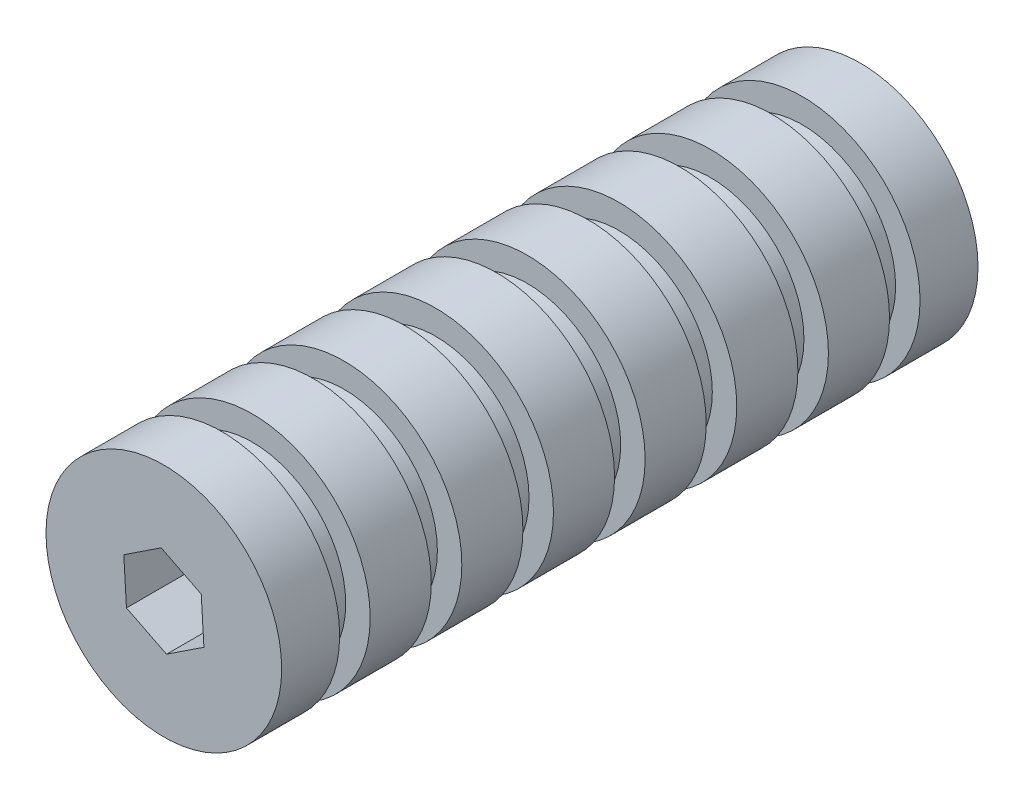
ISO-10303-21;
HEADER;
FILE_DESCRIPTION(('STEP AP214'),'2;1');
FILE_NAME('part.step','',(''),(''),'','','');
FILE_SCHEMA(('AUTOMOTIVE_DESIGN { 1 0 10303 214 1 1 1 1 }'));
ENDSEC;
DATA;
#1=APPLICATION_CONTEXT('core data for automotive mechanical design processes');
#2=APPLICATION_PROTOCOL_DEFINITION('international standard','automotive_design',2000,#1);
#3=PRODUCT_CONTEXT('',#1,'mechanical');
#4=PRODUCT('Part','Part','',(#3));
#5=PRODUCT_RELATED_PRODUCT_CATEGORY('part','',(#4));
#6=PRODUCT_DEFINITION_FORMATION('','',#4);
#7=PRODUCT_DEFINITION_CONTEXT('part definition',#1,'design');
#8=PRODUCT_DEFINITION('design','',#6,#7);
#9=PRODUCT_DEFINITION_SHAPE('','',#8);
#10=(LENGTH_UNIT() NAMED_UNIT(*) SI_UNIT(.MILLI.,.METRE.));
#11=(NAMED_UNIT(*) PLANE_ANGLE_UNIT() SI_UNIT($,.RADIAN.));
#12=(NAMED_UNIT(*) SI_UNIT($,.STERADIAN.) SOLID_ANGLE_UNIT());
#13=UNCERTAINTY_MEASURE_WITH_UNIT(LENGTH_MEASURE(1.E-05),#10,'distance_accuracy_value','');
#14=(GEOMETRIC_REPRESENTATION_CONTEXT(3) GLOBAL_UNCERTAINTY_ASSIGNED_CONTEXT((#13)) GLOBAL_UNIT_ASSIGNED_CONTEXT((#10,
#11,#12)) REPRESENTATION_CONTEXT('',''));
#15=CARTESIAN_POINT('',(0.,0.,0.));
#16=DIRECTION('',(0.,0.,1.));
#17=DIRECTION('',(1.,0.,0.));
#18=AXIS2_PLACEMENT_3D('',#15,#16,#17);
#19=CARTESIAN_POINT('',(0.,0.,0.));
#20=DIRECTION('',(0.,0.,1.));
#21=DIRECTION('',(1.,0.,0.));
#22=AXIS2_PLACEMENT_3D('',#19,#20,#21);
#23=CYLINDRICAL_SURFACE('',#22,19.2875);
#24=CARTESIAN_POINT('',(0.,0.,0.5155));
#25=DIRECTION('',(0.,0.,1.));
#26=DIRECTION('',(1.,0.,0.));
#27=AXIS2_PLACEMENT_3D('',#24,#25,#26);
#28=CIRCLE('',#27,19.2875);
#29=CARTESIAN_POINT('',(19.2875,0.,0.5155));
#30=VERTEX_POINT('',#29);
#31=EDGE_CURVE('E19',#30,#30,#28,.T.);
#32=ORIENTED_EDGE('',*,*,#31,.T.);
#33=EDGE_LOOP('',(#32));
#34=FACE_BOUND('',#33,.T.);
#35=CARTESIAN_POINT('',(0.,0.,10.));
#36=DIRECTION('',(0.,0.,1.));
#37=DIRECTION('',(1.,0.,0.));
#38=AXIS2_PLACEMENT_3D('',#35,#36,#37);
#39=CIRCLE('',#38,19.2875);
#40=CARTESIAN_POINT('',(19.2875,0.,10.));
#41=VERTEX_POINT('',#40);
#42=EDGE_CURVE('E80',#41,#41,#39,.T.);
#43=ORIENTED_EDGE('',*,*,#42,.F.);
#44=EDGE_LOOP('',(#43));
#45=FACE_BOUND('',#44,.T.);
#46=ADVANCED_FACE('F16',(#34,#45),#23,.T.);
#47=CARTESIAN_POINT('',(0.,0.,0.5155));
#48=DIRECTION('',(0.,0.,1.));
#49=DIRECTION('',(1.,0.,0.));
#50=AXIS2_PLACEMENT_3D('',#47,#48,#49);
#51=PLANE('',#50);
#52=DIRECTION('',(-0.8345119301207,-0.550989871491504,0.));
#53=VECTOR('',#52,1.);
#54=CARTESIAN_POINT('',(6.55825179957789,-3.27912589978895,0.5155));
#55=LINE('',#54,#53);
#56=CARTESIAN_POINT('',(6.55825179957789,-3.27912589978895,0.5155));
#57=VERTEX_POINT('',#56);
#58=CARTESIAN_POINT('',(0.439319568364208,-7.31917561274394,0.5155));
#59=VERTEX_POINT('',#58);
#60=EDGE_CURVE('E177',#57,#59,#55,.T.);
#61=ORIENTED_EDGE('',*,*,#60,.F.);
#62=DIRECTION('',(0.0599152608792156,-0.998203466991462,0.));
#63=VECTOR('',#62,1.);
#64=CARTESIAN_POINT('',(6.11893223121368,4.04004971295499,0.5155));
#65=LINE('',#64,#63);
#66=CARTESIAN_POINT('',(6.11893223121368,4.04004971295499,0.5155));
#67=VERTEX_POINT('',#66);
#68=EDGE_CURVE('E566',#67,#57,#65,.T.);
#69=ORIENTED_EDGE('',*,*,#68,.F.);
#70=DIRECTION('',(0.894427190999916,-0.447213595499959,0.));
#71=VECTOR('',#70,1.);
#72=CARTESIAN_POINT('',(-0.439319568364211,7.31917561274394,0.5155));
#73=LINE('',#72,#71);
#74=CARTESIAN_POINT('',(-0.439319568364214,7.31917561274394,0.5155));
#75=VERTEX_POINT('',#74);
#76=EDGE_CURVE('E561',#75,#67,#73,.T.);
#77=ORIENTED_EDGE('',*,*,#76,.F.);
#78=DIRECTION('',(0.8345119301207,0.550989871491504,0.));
#79=VECTOR('',#78,1.);
#80=CARTESIAN_POINT('',(-6.5582517995779,3.27912589978896,0.5155));
#81=LINE('',#80,#79);
#82=CARTESIAN_POINT('',(-6.5582517995779,3.27912589978896,0.5155));
#83=VERTEX_POINT('',#82);
#84=EDGE_CURVE('E85',#83,#75,#81,.T.);
#85=ORIENTED_EDGE('',*,*,#84,.F.);
#86=DIRECTION('',(-0.0599152608792152,0.998203466991462,0.));
#87=VECTOR('',#86,1.);
#88=CARTESIAN_POINT('',(-6.11893223121369,-4.04004971295499,0.5155));
#89=LINE('',#88,#87);
#90=CARTESIAN_POINT('',(-6.11893223121369,-4.04004971295499,0.5155));
#91=VERTEX_POINT('',#90);
#92=EDGE_CURVE('E66',#91,#83,#89,.T.);
#93=ORIENTED_EDGE('',*,*,#92,.F.);
#94=DIRECTION('',(-0.894427190999916,0.447213595499958,0.));
#95=VECTOR('',#94,1.);
#96=CARTESIAN_POINT('',(0.439319568364209,-7.31917561274394,0.5155));
#97=LINE('',#96,#95);
#98=EDGE_CURVE('E71',#59,#91,#97,.T.);
#99=ORIENTED_EDGE('',*,*,#98,.F.);
#100=EDGE_LOOP('',(#61,#69,#77,#85,#93,#99));
#101=FACE_BOUND('',#100,.T.);
#102=ORIENTED_EDGE('',*,*,#31,.F.);
#103=EDGE_LOOP('',(#102));
#104=FACE_BOUND('',#103,.T.);
#105=ADVANCED_FACE('F82',(#101,#104),#51,.F.);
#106=CARTESIAN_POINT('',(0.,0.,10.));
#107=DIRECTION('',(0.,0.,1.));
#108=DIRECTION('',(1.,0.,0.));
#109=AXIS2_PLACEMENT_3D('',#106,#107,#108);
#110=PLANE('',#109);
#111=CARTESIAN_POINT('',(0.,0.,10.));
#112=DIRECTION('',(0.,0.,1.));
#113=DIRECTION('',(1.,0.,0.));
#114=AXIS2_PLACEMENT_3D('',#111,#112,#113);
#115=CIRCLE('',#114,15.2875);
#116=CARTESIAN_POINT('',(15.2875,0.,10.));
#117=VERTEX_POINT('',#116);
#118=EDGE_CURVE('E174',#117,#117,#115,.T.);
#119=ORIENTED_EDGE('',*,*,#118,.F.);
#120=EDGE_LOOP('',(#119));
#121=FACE_BOUND('',#120,.T.);
#122=ORIENTED_EDGE('',*,*,#42,.T.);
#123=EDGE_LOOP('',(#122));
#124=FACE_BOUND('',#123,.T.);
#125=ADVANCED_FACE('F186',(#121,#124),#110,.T.);
#126=CARTESIAN_POINT('',(0.439319568364209,-7.31917561274394,0.));
#127=DIRECTION('',(0.447213595499958,0.894427190999916,0.));
#128=DIRECTION('',(-0.894427190999916,0.447213595499958,0.));
#129=AXIS2_PLACEMENT_3D('',#126,#127,#128);
#130=PLANE('',#129);
#131=DIRECTION('',(0.,0.,1.));
#132=VECTOR('',#131,1.);
#133=CARTESIAN_POINT('',(0.439319568364208,-7.31917561274394,0.));
#134=LINE('',#133,#132);
#135=CARTESIAN_POINT('',(0.439319568364209,-7.31917561274394,114.4845));
#136=VERTEX_POINT('',#135);
#137=EDGE_CURVE('E76',#59,#136,#134,.T.);
#138=ORIENTED_EDGE('',*,*,#137,.F.);
#139=ORIENTED_EDGE('',*,*,#98,.T.);
#140=DIRECTION('',(0.,0.,1.));
#141=VECTOR('',#140,1.);
#142=CARTESIAN_POINT('',(-6.11893223121369,-4.04004971295499,0.));
#143=LINE('',#142,#141);
#144=CARTESIAN_POINT('',(-6.11893223121369,-4.04004971295499,114.4845));
#145=VERTEX_POINT('',#144);
#146=EDGE_CURVE('E73',#145,#91,#143,.F.);
#147=ORIENTED_EDGE('',*,*,#146,.F.);
#148=DIRECTION('',(-0.894427190999916,0.447213595499958,0.));
#149=VECTOR('',#148,1.);
#150=CARTESIAN_POINT('',(0.439319568364209,-7.31917561274394,114.4845));
#151=LINE('',#150,#149);
#152=EDGE_CURVE('E176',#136,#145,#151,.T.);
#153=ORIENTED_EDGE('',*,*,#152,.F.);
#154=EDGE_LOOP('',(#138,#139,#147,#153));
#155=FACE_BOUND('',#154,.T.);
#156=ADVANCED_FACE('F72',(#155),#130,.T.);
#157=CARTESIAN_POINT('',(-6.11893223121369,-4.04004971295499,0.));
#158=DIRECTION('',(0.998203466991462,0.0599152608792152,0.));
#159=DIRECTION('',(-0.0599152608792152,0.998203466991462,0.));
#160=AXIS2_PLACEMENT_3D('',#157,#158,#159);
#161=PLANE('',#160);
#162=ORIENTED_EDGE('',*,*,#146,.T.);
#163=ORIENTED_EDGE('',*,*,#92,.T.);
#164=DIRECTION('',(0.,0.,1.));
#165=VECTOR('',#164,1.);
#166=CARTESIAN_POINT('',(-6.5582517995779,3.27912589978896,0.));
#167=LINE('',#166,#165);
#168=CARTESIAN_POINT('',(-6.5582517995779,3.27912589978896,114.4845));
#169=VERTEX_POINT('',#168);
#170=EDGE_CURVE('E87',#169,#83,#167,.F.);
#171=ORIENTED_EDGE('',*,*,#170,.F.);
#172=DIRECTION('',(-0.0599152608792158,0.998203466991462,0.));
#173=VECTOR('',#172,1.);
#174=CARTESIAN_POINT('',(-6.11893223121369,-4.04004971295499,114.4845));
#175=LINE('',#174,#173);
#176=EDGE_CURVE('E91',#145,#169,#175,.T.);
#177=ORIENTED_EDGE('',*,*,#176,.F.);
#178=EDGE_LOOP('',(#162,#163,#171,#177));
#179=FACE_BOUND('',#178,.T.);
#180=ADVANCED_FACE('F89',(#179),#161,.T.);
#181=CARTESIAN_POINT('',(-6.5582517995779,3.27912589978896,0.));
#182=DIRECTION('',(0.550989871491504,-0.8345119301207,0.));
#183=DIRECTION('',(0.8345119301207,0.550989871491504,0.));
#184=AXIS2_PLACEMENT_3D('',#181,#182,#183);
#185=PLANE('',#184);
#186=ORIENTED_EDGE('',*,*,#170,.T.);
#187=ORIENTED_EDGE('',*,*,#84,.T.);
#188=DIRECTION('',(0.,0.,1.));
#189=VECTOR('',#188,1.);
#190=CARTESIAN_POINT('',(-0.439319568364212,7.31917561274394,0.));
#191=LINE('',#190,#189);
#192=CARTESIAN_POINT('',(-0.439319568364214,7.31917561274394,114.4845));
#193=VERTEX_POINT('',#192);
#194=EDGE_CURVE('E556',#193,#75,#191,.F.);
#195=ORIENTED_EDGE('',*,*,#194,.F.);
#196=DIRECTION('',(0.834511930120701,0.550989871491503,0.));
#197=VECTOR('',#196,1.);
#198=CARTESIAN_POINT('',(-6.5582517995779,3.27912589978896,114.4845));
#199=LINE('',#198,#197);
#200=EDGE_CURVE('E555',#169,#193,#199,.T.);
#201=ORIENTED_EDGE('',*,*,#200,.F.);
#202=EDGE_LOOP('',(#186,#187,#195,#201));
#203=FACE_BOUND('',#202,.T.);
#204=ADVANCED_FACE('F320',(#203),#185,.T.);
#205=CARTESIAN_POINT('',(-0.439319568364211,7.31917561274394,0.));
#206=DIRECTION('',(-0.447213595499959,-0.894427190999916,0.));
#207=DIRECTION('',(0.894427190999916,-0.447213595499959,0.));
#208=AXIS2_PLACEMENT_3D('',#205,#206,#207);
#209=PLANE('',#208);
#210=ORIENTED_EDGE('',*,*,#194,.T.);
#211=ORIENTED_EDGE('',*,*,#76,.T.);
#212=DIRECTION('',(0.,0.,1.));
#213=VECTOR('',#212,1.);
#214=CARTESIAN_POINT('',(6.11893223121368,4.04004971295499,0.));
#215=LINE('',#214,#213);
#216=CARTESIAN_POINT('',(6.11893223121368,4.04004971295499,114.4845));
#217=VERTEX_POINT('',#216);
#218=EDGE_CURVE('E563',#217,#67,#215,.F.);
#219=ORIENTED_EDGE('',*,*,#218,.F.);
#220=DIRECTION('',(0.894427190999916,-0.447213595499958,0.));
#221=VECTOR('',#220,1.);
#222=CARTESIAN_POINT('',(-0.439319568364212,7.31917561274394,114.4845));
#223=LINE('',#222,#221);
#224=EDGE_CURVE('E574',#193,#217,#223,.T.);
#225=ORIENTED_EDGE('',*,*,#224,.F.);
#226=EDGE_LOOP('',(#210,#211,#219,#225));
#227=FACE_BOUND('',#226,.T.);
#228=ADVANCED_FACE('F317',(#227),#209,.T.);
#229=CARTESIAN_POINT('',(6.11893223121368,4.04004971295499,0.));
#230=DIRECTION('',(-0.998203466991462,-0.0599152608792156,0.));
#231=DIRECTION('',(0.0599152608792156,-0.998203466991462,0.));
#232=AXIS2_PLACEMENT_3D('',#229,#230,#231);
#233=PLANE('',#232);
#234=ORIENTED_EDGE('',*,*,#218,.T.);
#235=ORIENTED_EDGE('',*,*,#68,.T.);
#236=DIRECTION('',(0.,0.,1.));
#237=VECTOR('',#236,1.);
#238=CARTESIAN_POINT('',(6.55825179957789,-3.27912589978895,0.));
#239=LINE('',#238,#237);
#240=CARTESIAN_POINT('',(6.55825179957789,-3.27912589978895,114.4845));
#241=VERTEX_POINT('',#240);
#242=EDGE_CURVE('E34',#241,#57,#239,.F.);
#243=ORIENTED_EDGE('',*,*,#242,.F.);
#244=DIRECTION('',(0.0599152608792157,-0.998203466991462,0.));
#245=VECTOR('',#244,1.);
#246=CARTESIAN_POINT('',(6.11893223121368,4.04004971295499,114.4845));
#247=LINE('',#246,#245);
#248=EDGE_CURVE('E577',#217,#241,#247,.T.);
#249=ORIENTED_EDGE('',*,*,#248,.F.);
#250=EDGE_LOOP('',(#234,#235,#243,#249));
#251=FACE_BOUND('',#250,.T.);
#252=ADVANCED_FACE('F313',(#251),#233,.T.);
#253=CARTESIAN_POINT('',(6.55825179957789,-3.27912589978895,0.));
#254=DIRECTION('',(-0.550989871491504,0.8345119301207,0.));
#255=DIRECTION('',(-0.8345119301207,-0.550989871491504,0.));
#256=AXIS2_PLACEMENT_3D('',#253,#254,#255);
#257=PLANE('',#256);
#258=ORIENTED_EDGE('',*,*,#242,.T.);
#259=ORIENTED_EDGE('',*,*,#60,.T.);
#260=ORIENTED_EDGE('',*,*,#137,.T.);
#261=DIRECTION('',(-0.8345119301207,-0.550989871491504,0.));
#262=VECTOR('',#261,1.);
#263=CARTESIAN_POINT('',(6.55825179957789,-3.27912589978895,114.4845));
#264=LINE('',#263,#262);
#265=EDGE_CURVE('E173',#241,#136,#264,.T.);
#266=ORIENTED_EDGE('',*,*,#265,.F.);
#267=EDGE_LOOP('',(#258,#259,#260,#266));
#268=FACE_BOUND('',#267,.T.);
#269=ADVANCED_FACE('F309',(#268),#257,.T.);
#270=CARTESIAN_POINT('',(0.,0.,10.));
#271=DIRECTION('',(0.,0.,1.));
#272=DIRECTION('',(1.,0.,0.));
#273=AXIS2_PLACEMENT_3D('',#270,#271,#272);
#274=CYLINDRICAL_SURFACE('',#273,15.2875);
#275=CARTESIAN_POINT('',(0.,0.,15.));
#276=DIRECTION('',(0.,0.,1.));
#277=DIRECTION('',(1.,0.,0.));
#278=AXIS2_PLACEMENT_3D('',#275,#276,#277);
#279=CIRCLE('',#278,15.2875);
#280=CARTESIAN_POINT('',(15.2875,0.,15.));
#281=VERTEX_POINT('',#280);
#282=EDGE_CURVE('E170',#281,#281,#279,.F.);
#283=ORIENTED_EDGE('',*,*,#282,.T.);
#284=EDGE_LOOP('',(#283));
#285=FACE_BOUND('',#284,.T.);
#286=ORIENTED_EDGE('',*,*,#118,.T.);
#287=EDGE_LOOP('',(#286));
#288=FACE_BOUND('',#287,.T.);
#289=ADVANCED_FACE('F305',(#285,#288),#274,.T.);
#290=CARTESIAN_POINT('',(0.,0.,114.4845));
#291=DIRECTION('',(0.,0.,1.));
#292=DIRECTION('',(1.,0.,0.));
#293=AXIS2_PLACEMENT_3D('',#290,#291,#292);
#294=PLANE('',#293);
#295=ORIENTED_EDGE('',*,*,#248,.T.);
#296=ORIENTED_EDGE('',*,*,#265,.T.);
#297=ORIENTED_EDGE('',*,*,#152,.T.);
#298=ORIENTED_EDGE('',*,*,#176,.T.);
#299=ORIENTED_EDGE('',*,*,#200,.T.);
#300=ORIENTED_EDGE('',*,*,#224,.T.);
#301=EDGE_LOOP('',(#295,#296,#297,#298,#299,#300));
#302=FACE_BOUND('',#301,.T.);
#303=CARTESIAN_POINT('',(0.,0.,114.4845));
#304=DIRECTION('',(0.,0.,1.));
#305=DIRECTION('',(1.,0.,0.));
#306=AXIS2_PLACEMENT_3D('',#303,#304,#305);
#307=CIRCLE('',#306,19.2875);
#308=CARTESIAN_POINT('',(19.2875,0.,114.4845));
#309=VERTEX_POINT('',#308);
#310=EDGE_CURVE('E167',#309,#309,#307,.F.);
#311=ORIENTED_EDGE('',*,*,#310,.F.);
#312=EDGE_LOOP('',(#311));
#313=FACE_BOUND('',#312,.T.);
#314=ADVANCED_FACE('F301',(#302,#313),#294,.T.);
#315=CARTESIAN_POINT('',(0.,0.,15.));
#316=DIRECTION('',(0.,0.,1.));
#317=DIRECTION('',(1.,0.,0.));
#318=AXIS2_PLACEMENT_3D('',#315,#316,#317);
#319=PLANE('',#318);
#320=ORIENTED_EDGE('',*,*,#282,.F.);
#321=EDGE_LOOP('',(#320));
#322=FACE_BOUND('',#321,.T.);
#323=CARTESIAN_POINT('',(0.,0.,15.));
#324=DIRECTION('',(0.,0.,1.));
#325=DIRECTION('',(1.,0.,0.));
#326=AXIS2_PLACEMENT_3D('',#323,#324,#325);
#327=CIRCLE('',#326,19.2875);
#328=CARTESIAN_POINT('',(19.2875,0.,15.));
#329=VERTEX_POINT('',#328);
#330=EDGE_CURVE('E164',#329,#329,#327,.T.);
#331=ORIENTED_EDGE('',*,*,#330,.F.);
#332=EDGE_LOOP('',(#331));
#333=FACE_BOUND('',#332,.T.);
#334=ADVANCED_FACE('F297',(#322,#333),#319,.F.);
#335=CARTESIAN_POINT('',(0.,0.,0.));
#336=DIRECTION('',(0.,0.,1.));
#337=DIRECTION('',(1.,0.,0.));
#338=AXIS2_PLACEMENT_3D('',#335,#336,#337);
#339=CYLINDRICAL_SURFACE('',#338,19.2875);
#340=CARTESIAN_POINT('',(0.,0.,105.));
#341=DIRECTION('',(0.,0.,1.));
#342=DIRECTION('',(1.,0.,0.));
#343=AXIS2_PLACEMENT_3D('',#340,#341,#342);
#344=CIRCLE('',#343,19.2875);
#345=CARTESIAN_POINT('',(19.2875,0.,105.));
#346=VERTEX_POINT('',#345);
#347=EDGE_CURVE('E161',#346,#346,#344,.T.);
#348=ORIENTED_EDGE('',*,*,#347,.T.);
#349=EDGE_LOOP('',(#348));
#350=FACE_BOUND('',#349,.T.);
#351=ORIENTED_EDGE('',*,*,#310,.T.);
#352=EDGE_LOOP('',(#351));
#353=FACE_BOUND('',#352,.T.);
#354=ADVANCED_FACE('F293',(#350,#353),#339,.T.);
#355=CARTESIAN_POINT('',(0.,0.,0.));
#356=DIRECTION('',(0.,0.,1.));
#357=DIRECTION('',(1.,0.,0.));
#358=AXIS2_PLACEMENT_3D('',#355,#356,#357);
#359=CYLINDRICAL_SURFACE('',#358,19.2875);
#360=ORIENTED_EDGE('',*,*,#330,.T.);
#361=EDGE_LOOP('',(#360));
#362=FACE_BOUND('',#361,.T.);
#363=CARTESIAN_POINT('',(0.,0.,25.));
#364=DIRECTION('',(0.,0.,1.));
#365=DIRECTION('',(1.,0.,0.));
#366=AXIS2_PLACEMENT_3D('',#363,#364,#365);
#367=CIRCLE('',#366,19.2875);
#368=CARTESIAN_POINT('',(19.2875,0.,25.));
#369=VERTEX_POINT('',#368);
#370=EDGE_CURVE('E158',#369,#369,#367,.T.);
#371=ORIENTED_EDGE('',*,*,#370,.F.);
#372=EDGE_LOOP('',(#371));
#373=FACE_BOUND('',#372,.T.);
#374=ADVANCED_FACE('F289',(#362,#373),#359,.T.);
#375=CARTESIAN_POINT('',(0.,0.,105.));
#376=DIRECTION('',(0.,0.,1.));
#377=DIRECTION('',(1.,0.,0.));
#378=AXIS2_PLACEMENT_3D('',#375,#376,#377);
#379=PLANE('',#378);
#380=CARTESIAN_POINT('',(0.,0.,105.));
#381=DIRECTION('',(0.,0.,1.));
#382=DIRECTION('',(1.,0.,0.));
#383=AXIS2_PLACEMENT_3D('',#380,#381,#382);
#384=CIRCLE('',#383,15.2875);
#385=CARTESIAN_POINT('',(15.2875,0.,105.));
#386=VERTEX_POINT('',#385);
#387=EDGE_CURVE('E155',#386,#386,#384,.F.);
#388=ORIENTED_EDGE('',*,*,#387,.F.);
#389=EDGE_LOOP('',(#388));
#390=FACE_BOUND('',#389,.T.);
#391=ORIENTED_EDGE('',*,*,#347,.F.);
#392=EDGE_LOOP('',(#391));
#393=FACE_BOUND('',#392,.T.);
#394=ADVANCED_FACE('F285',(#390,#393),#379,.F.);
#395=CARTESIAN_POINT('',(0.,0.,25.));
#396=DIRECTION('',(0.,0.,1.));
#397=DIRECTION('',(1.,0.,0.));
#398=AXIS2_PLACEMENT_3D('',#395,#396,#397);
#399=PLANE('',#398);
#400=CARTESIAN_POINT('',(0.,0.,25.));
#401=DIRECTION('',(0.,0.,1.));
#402=DIRECTION('',(1.,0.,0.));
#403=AXIS2_PLACEMENT_3D('',#400,#401,#402);
#404=CIRCLE('',#403,15.2875);
#405=CARTESIAN_POINT('',(15.2875,0.,25.));
#406=VERTEX_POINT('',#405);
#407=EDGE_CURVE('E152',#406,#406,#404,.T.);
#408=ORIENTED_EDGE('',*,*,#407,.F.);
#409=EDGE_LOOP('',(#408));
#410=FACE_BOUND('',#409,.T.);
#411=ORIENTED_EDGE('',*,*,#370,.T.);
#412=EDGE_LOOP('',(#411));
#413=FACE_BOUND('',#412,.T.);
#414=ADVANCED_FACE('F281',(#410,#413),#399,.T.);
#415=CARTESIAN_POINT('',(0.,0.,100.));
#416=DIRECTION('',(0.,0.,1.));
#417=DIRECTION('',(1.,0.,0.));
#418=AXIS2_PLACEMENT_3D('',#415,#416,#417);
#419=CYLINDRICAL_SURFACE('',#418,15.2875);
#420=ORIENTED_EDGE('',*,*,#387,.T.);
#421=EDGE_LOOP('',(#420));
#422=FACE_BOUND('',#421,.T.);
#423=CARTESIAN_POINT('',(0.,0.,100.));
#424=DIRECTION('',(0.,0.,1.));
#425=DIRECTION('',(1.,0.,0.));
#426=AXIS2_PLACEMENT_3D('',#423,#424,#425);
#427=CIRCLE('',#426,15.2875);
#428=CARTESIAN_POINT('',(15.2875,0.,100.));
#429=VERTEX_POINT('',#428);
#430=EDGE_CURVE('E149',#429,#429,#427,.F.);
#431=ORIENTED_EDGE('',*,*,#430,.F.);
#432=EDGE_LOOP('',(#431));
#433=FACE_BOUND('',#432,.T.);
#434=ADVANCED_FACE('F277',(#422,#433),#419,.T.);
#435=CARTESIAN_POINT('',(0.,0.,25.));
#436=DIRECTION('',(0.,0.,1.));
#437=DIRECTION('',(1.,0.,0.));
#438=AXIS2_PLACEMENT_3D('',#435,#436,#437);
#439=CYLINDRICAL_SURFACE('',#438,15.2875);
#440=CARTESIAN_POINT('',(0.,0.,30.));
#441=DIRECTION('',(0.,0.,1.));
#442=DIRECTION('',(1.,0.,0.));
#443=AXIS2_PLACEMENT_3D('',#440,#441,#442);
#444=CIRCLE('',#443,15.2875);
#445=CARTESIAN_POINT('',(15.2875,0.,30.));
#446=VERTEX_POINT('',#445);
#447=EDGE_CURVE('E146',#446,#446,#444,.F.);
#448=ORIENTED_EDGE('',*,*,#447,.T.);
#449=EDGE_LOOP('',(#448));
#450=FACE_BOUND('',#449,.T.);
#451=ORIENTED_EDGE('',*,*,#407,.T.);
#452=EDGE_LOOP('',(#451));
#453=FACE_BOUND('',#452,.T.);
#454=ADVANCED_FACE('F273',(#450,#453),#439,.T.);
#455=CARTESIAN_POINT('',(0.,0.,100.));
#456=DIRECTION('',(0.,0.,1.));
#457=DIRECTION('',(1.,0.,0.));
#458=AXIS2_PLACEMENT_3D('',#455,#456,#457);
#459=PLANE('',#458);
#460=ORIENTED_EDGE('',*,*,#430,.T.);
#461=EDGE_LOOP('',(#460));
#462=FACE_BOUND('',#461,.T.);
#463=CARTESIAN_POINT('',(0.,0.,100.));
#464=DIRECTION('',(0.,0.,1.));
#465=DIRECTION('',(1.,0.,0.));
#466=AXIS2_PLACEMENT_3D('',#463,#464,#465);
#467=CIRCLE('',#466,19.2875);
#468=CARTESIAN_POINT('',(19.2875,0.,100.));
#469=VERTEX_POINT('',#468);
#470=EDGE_CURVE('E143',#469,#469,#467,.F.);
#471=ORIENTED_EDGE('',*,*,#470,.F.);
#472=EDGE_LOOP('',(#471));
#473=FACE_BOUND('',#472,.T.);
#474=ADVANCED_FACE('F269',(#462,#473),#459,.T.);
#475=CARTESIAN_POINT('',(0.,0.,30.));
#476=DIRECTION('',(0.,0.,1.));
#477=DIRECTION('',(1.,0.,0.));
#478=AXIS2_PLACEMENT_3D('',#475,#476,#477);
#479=PLANE('',#478);
#480=ORIENTED_EDGE('',*,*,#447,.F.);
#481=EDGE_LOOP('',(#480));
#482=FACE_BOUND('',#481,.T.);
#483=CARTESIAN_POINT('',(0.,0.,30.));
#484=DIRECTION('',(0.,0.,1.));
#485=DIRECTION('',(1.,0.,0.));
#486=AXIS2_PLACEMENT_3D('',#483,#484,#485);
#487=CIRCLE('',#486,19.2875);
#488=CARTESIAN_POINT('',(19.2875,0.,30.));
#489=VERTEX_POINT('',#488);
#490=EDGE_CURVE('E140',#489,#489,#487,.T.);
#491=ORIENTED_EDGE('',*,*,#490,.F.);
#492=EDGE_LOOP('',(#491));
#493=FACE_BOUND('',#492,.T.);
#494=ADVANCED_FACE('F265',(#482,#493),#479,.F.);
#495=CARTESIAN_POINT('',(0.,0.,0.));
#496=DIRECTION('',(0.,0.,1.));
#497=DIRECTION('',(1.,0.,0.));
#498=AXIS2_PLACEMENT_3D('',#495,#496,#497);
#499=CYLINDRICAL_SURFACE('',#498,19.2875);
#500=CARTESIAN_POINT('',(0.,0.,90.));
#501=DIRECTION('',(0.,0.,1.));
#502=DIRECTION('',(1.,0.,0.));
#503=AXIS2_PLACEMENT_3D('',#500,#501,#502);
#504=CIRCLE('',#503,19.2875);
#505=CARTESIAN_POINT('',(19.2875,0.,90.));
#506=VERTEX_POINT('',#505);
#507=EDGE_CURVE('E137',#506,#506,#504,.T.);
#508=ORIENTED_EDGE('',*,*,#507,.T.);
#509=EDGE_LOOP('',(#508));
#510=FACE_BOUND('',#509,.T.);
#511=ORIENTED_EDGE('',*,*,#470,.T.);
#512=EDGE_LOOP('',(#511));
#513=FACE_BOUND('',#512,.T.);
#514=ADVANCED_FACE('F261',(#510,#513),#499,.T.);
#515=CARTESIAN_POINT('',(0.,0.,0.));
#516=DIRECTION('',(0.,0.,1.));
#517=DIRECTION('',(1.,0.,0.));
#518=AXIS2_PLACEMENT_3D('',#515,#516,#517);
#519=CYLINDRICAL_SURFACE('',#518,19.2875);
#520=ORIENTED_EDGE('',*,*,#490,.T.);
#521=EDGE_LOOP('',(#520));
#522=FACE_BOUND('',#521,.T.);
#523=CARTESIAN_POINT('',(0.,0.,40.));
#524=DIRECTION('',(0.,0.,1.));
#525=DIRECTION('',(1.,0.,0.));
#526=AXIS2_PLACEMENT_3D('',#523,#524,#525);
#527=CIRCLE('',#526,19.2875);
#528=CARTESIAN_POINT('',(19.2875,0.,40.));
#529=VERTEX_POINT('',#528);
#530=EDGE_CURVE('E134',#529,#529,#527,.T.);
#531=ORIENTED_EDGE('',*,*,#530,.F.);
#532=EDGE_LOOP('',(#531));
#533=FACE_BOUND('',#532,.T.);
#534=ADVANCED_FACE('F257',(#522,#533),#519,.T.);
#535=CARTESIAN_POINT('',(0.,0.,90.));
#536=DIRECTION('',(0.,0.,1.));
#537=DIRECTION('',(1.,0.,0.));
#538=AXIS2_PLACEMENT_3D('',#535,#536,#537);
#539=PLANE('',#538);
#540=CARTESIAN_POINT('',(0.,0.,90.));
#541=DIRECTION('',(0.,0.,1.));
#542=DIRECTION('',(1.,0.,0.));
#543=AXIS2_PLACEMENT_3D('',#540,#541,#542);
#544=CIRCLE('',#543,15.2875);
#545=CARTESIAN_POINT('',(15.2875,0.,90.));
#546=VERTEX_POINT('',#545);
#547=EDGE_CURVE('E131',#546,#546,#544,.F.);
#548=ORIENTED_EDGE('',*,*,#547,.F.);
#549=EDGE_LOOP('',(#548));
#550=FACE_BOUND('',#549,.T.);
#551=ORIENTED_EDGE('',*,*,#507,.F.);
#552=EDGE_LOOP('',(#551));
#553=FACE_BOUND('',#552,.T.);
#554=ADVANCED_FACE('F253',(#550,#553),#539,.F.);
#555=CARTESIAN_POINT('',(0.,0.,40.));
#556=DIRECTION('',(0.,0.,1.));
#557=DIRECTION('',(1.,0.,0.));
#558=AXIS2_PLACEMENT_3D('',#555,#556,#557);
#559=PLANE('',#558);
#560=CARTESIAN_POINT('',(0.,0.,40.));
#561=DIRECTION('',(0.,0.,1.));
#562=DIRECTION('',(1.,0.,0.));
#563=AXIS2_PLACEMENT_3D('',#560,#561,#562);
#564=CIRCLE('',#563,15.2875);
#565=CARTESIAN_POINT('',(15.2875,0.,40.));
#566=VERTEX_POINT('',#565);
#567=EDGE_CURVE('E128',#566,#566,#564,.T.);
#568=ORIENTED_EDGE('',*,*,#567,.F.);
#569=EDGE_LOOP('',(#568));
#570=FACE_BOUND('',#569,.T.);
#571=ORIENTED_EDGE('',*,*,#530,.T.);
#572=EDGE_LOOP('',(#571));
#573=FACE_BOUND('',#572,.T.);
#574=ADVANCED_FACE('F249',(#570,#573),#559,.T.);
#575=CARTESIAN_POINT('',(0.,0.,85.));
#576=DIRECTION('',(0.,0.,1.));
#577=DIRECTION('',(1.,0.,0.));
#578=AXIS2_PLACEMENT_3D('',#575,#576,#577);
#579=CYLINDRICAL_SURFACE('',#578,15.2875);
#580=ORIENTED_EDGE('',*,*,#547,.T.);
#581=EDGE_LOOP('',(#580));
#582=FACE_BOUND('',#581,.T.);
#583=CARTESIAN_POINT('',(0.,0.,85.));
#584=DIRECTION('',(0.,0.,1.));
#585=DIRECTION('',(1.,0.,0.));
#586=AXIS2_PLACEMENT_3D('',#583,#584,#585);
#587=CIRCLE('',#586,15.2875);
#588=CARTESIAN_POINT('',(15.2875,0.,85.));
#589=VERTEX_POINT('',#588);
#590=EDGE_CURVE('E125',#589,#589,#587,.F.);
#591=ORIENTED_EDGE('',*,*,#590,.F.);
#592=EDGE_LOOP('',(#591));
#593=FACE_BOUND('',#592,.T.);
#594=ADVANCED_FACE('F245',(#582,#593),#579,.T.);
#595=CARTESIAN_POINT('',(0.,0.,40.));
#596=DIRECTION('',(0.,0.,1.));
#597=DIRECTION('',(1.,0.,0.));
#598=AXIS2_PLACEMENT_3D('',#595,#596,#597);
#599=CYLINDRICAL_SURFACE('',#598,15.2875);
#600=CARTESIAN_POINT('',(0.,0.,45.));
#601=DIRECTION('',(0.,0.,1.));
#602=DIRECTION('',(1.,0.,0.));
#603=AXIS2_PLACEMENT_3D('',#600,#601,#602);
#604=CIRCLE('',#603,15.2875);
#605=CARTESIAN_POINT('',(15.2875,0.,45.));
#606=VERTEX_POINT('',#605);
#607=EDGE_CURVE('E122',#606,#606,#604,.F.);
#608=ORIENTED_EDGE('',*,*,#607,.T.);
#609=EDGE_LOOP('',(#608));
#610=FACE_BOUND('',#609,.T.);
#611=ORIENTED_EDGE('',*,*,#567,.T.);
#612=EDGE_LOOP('',(#611));
#613=FACE_BOUND('',#612,.T.);
#614=ADVANCED_FACE('F241',(#610,#613),#599,.T.);
#615=CARTESIAN_POINT('',(0.,0.,85.));
#616=DIRECTION('',(0.,0.,1.));
#617=DIRECTION('',(1.,0.,0.));
#618=AXIS2_PLACEMENT_3D('',#615,#616,#617);
#619=PLANE('',#618);
#620=ORIENTED_EDGE('',*,*,#590,.T.);
#621=EDGE_LOOP('',(#620));
#622=FACE_BOUND('',#621,.T.);
#623=CARTESIAN_POINT('',(0.,0.,85.));
#624=DIRECTION('',(0.,0.,1.));
#625=DIRECTION('',(1.,0.,0.));
#626=AXIS2_PLACEMENT_3D('',#623,#624,#625);
#627=CIRCLE('',#626,19.2875);
#628=CARTESIAN_POINT('',(19.2875,0.,85.));
#629=VERTEX_POINT('',#628);
#630=EDGE_CURVE('E119',#629,#629,#627,.F.);
#631=ORIENTED_EDGE('',*,*,#630,.F.);
#632=EDGE_LOOP('',(#631));
#633=FACE_BOUND('',#632,.T.);
#634=ADVANCED_FACE('F237',(#622,#633),#619,.T.);
#635=CARTESIAN_POINT('',(0.,0.,45.));
#636=DIRECTION('',(0.,0.,1.));
#637=DIRECTION('',(1.,0.,0.));
#638=AXIS2_PLACEMENT_3D('',#635,#636,#637);
#639=PLANE('',#638);
#640=ORIENTED_EDGE('',*,*,#607,.F.);
#641=EDGE_LOOP('',(#640));
#642=FACE_BOUND('',#641,.T.);
#643=CARTESIAN_POINT('',(0.,0.,45.));
#644=DIRECTION('',(0.,0.,1.));
#645=DIRECTION('',(1.,0.,0.));
#646=AXIS2_PLACEMENT_3D('',#643,#644,#645);
#647=CIRCLE('',#646,19.2875);
#648=CARTESIAN_POINT('',(19.2875,0.,45.));
#649=VERTEX_POINT('',#648);
#650=EDGE_CURVE('E116',#649,#649,#647,.T.);
#651=ORIENTED_EDGE('',*,*,#650,.F.);
#652=EDGE_LOOP('',(#651));
#653=FACE_BOUND('',#652,.T.);
#654=ADVANCED_FACE('F233',(#642,#653),#639,.F.);
#655=CARTESIAN_POINT('',(0.,0.,0.));
#656=DIRECTION('',(0.,0.,1.));
#657=DIRECTION('',(1.,0.,0.));
#658=AXIS2_PLACEMENT_3D('',#655,#656,#657);
#659=CYLINDRICAL_SURFACE('',#658,19.2875);
#660=CARTESIAN_POINT('',(0.,0.,75.));
#661=DIRECTION('',(0.,0.,1.));
#662=DIRECTION('',(1.,0.,0.));
#663=AXIS2_PLACEMENT_3D('',#660,#661,#662);
#664=CIRCLE('',#663,19.2875);
#665=CARTESIAN_POINT('',(19.2875,0.,75.));
#666=VERTEX_POINT('',#665);
#667=EDGE_CURVE('E113',#666,#666,#664,.T.);
#668=ORIENTED_EDGE('',*,*,#667,.T.);
#669=EDGE_LOOP('',(#668));
#670=FACE_BOUND('',#669,.T.);
#671=ORIENTED_EDGE('',*,*,#630,.T.);
#672=EDGE_LOOP('',(#671));
#673=FACE_BOUND('',#672,.T.);
#674=ADVANCED_FACE('F229',(#670,#673),#659,.T.);
#675=CARTESIAN_POINT('',(0.,0.,0.));
#676=DIRECTION('',(0.,0.,1.));
#677=DIRECTION('',(1.,0.,0.));
#678=AXIS2_PLACEMENT_3D('',#675,#676,#677);
#679=CYLINDRICAL_SURFACE('',#678,19.2875);
#680=ORIENTED_EDGE('',*,*,#650,.T.);
#681=EDGE_LOOP('',(#680));
#682=FACE_BOUND('',#681,.T.);
#683=CARTESIAN_POINT('',(0.,0.,55.));
#684=DIRECTION('',(0.,0.,1.));
#685=DIRECTION('',(1.,0.,0.));
#686=AXIS2_PLACEMENT_3D('',#683,#684,#685);
#687=CIRCLE('',#686,19.2875);
#688=CARTESIAN_POINT('',(19.2875,0.,55.));
#689=VERTEX_POINT('',#688);
#690=EDGE_CURVE('E110',#689,#689,#687,.T.);
#691=ORIENTED_EDGE('',*,*,#690,.F.);
#692=EDGE_LOOP('',(#691));
#693=FACE_BOUND('',#692,.T.);
#694=ADVANCED_FACE('F225',(#682,#693),#679,.T.);
#695=CARTESIAN_POINT('',(0.,0.,75.));
#696=DIRECTION('',(0.,0.,1.));
#697=DIRECTION('',(1.,0.,0.));
#698=AXIS2_PLACEMENT_3D('',#695,#696,#697);
#699=PLANE('',#698);
#700=CARTESIAN_POINT('',(0.,0.,75.));
#701=DIRECTION('',(0.,0.,1.));
#702=DIRECTION('',(1.,0.,0.));
#703=AXIS2_PLACEMENT_3D('',#700,#701,#702);
#704=CIRCLE('',#703,15.2875);
#705=CARTESIAN_POINT('',(15.2875,0.,75.));
#706=VERTEX_POINT('',#705);
#707=EDGE_CURVE('E107',#706,#706,#704,.F.);
#708=ORIENTED_EDGE('',*,*,#707,.F.);
#709=EDGE_LOOP('',(#708));
#710=FACE_BOUND('',#709,.T.);
#711=ORIENTED_EDGE('',*,*,#667,.F.);
#712=EDGE_LOOP('',(#711));
#713=FACE_BOUND('',#712,.T.);
#714=ADVANCED_FACE('F221',(#710,#713),#699,.F.);
#715=CARTESIAN_POINT('',(0.,0.,55.));
#716=DIRECTION('',(0.,0.,1.));
#717=DIRECTION('',(1.,0.,0.));
#718=AXIS2_PLACEMENT_3D('',#715,#716,#717);
#719=PLANE('',#718);
#720=CARTESIAN_POINT('',(0.,0.,55.));
#721=DIRECTION('',(0.,0.,1.));
#722=DIRECTION('',(1.,0.,0.));
#723=AXIS2_PLACEMENT_3D('',#720,#721,#722);
#724=CIRCLE('',#723,15.2875);
#725=CARTESIAN_POINT('',(15.2875,0.,55.));
#726=VERTEX_POINT('',#725);
#727=EDGE_CURVE('E104',#726,#726,#724,.T.);
#728=ORIENTED_EDGE('',*,*,#727,.F.);
#729=EDGE_LOOP('',(#728));
#730=FACE_BOUND('',#729,.T.);
#731=ORIENTED_EDGE('',*,*,#690,.T.);
#732=EDGE_LOOP('',(#731));
#733=FACE_BOUND('',#732,.T.);
#734=ADVANCED_FACE('F217',(#730,#733),#719,.T.);
#735=CARTESIAN_POINT('',(0.,0.,70.));
#736=DIRECTION('',(0.,0.,1.));
#737=DIRECTION('',(1.,0.,0.));
#738=AXIS2_PLACEMENT_3D('',#735,#736,#737);
#739=CYLINDRICAL_SURFACE('',#738,15.2875);
#740=ORIENTED_EDGE('',*,*,#707,.T.);
#741=EDGE_LOOP('',(#740));
#742=FACE_BOUND('',#741,.T.);
#743=CARTESIAN_POINT('',(0.,0.,70.));
#744=DIRECTION('',(0.,0.,1.));
#745=DIRECTION('',(1.,0.,0.));
#746=AXIS2_PLACEMENT_3D('',#743,#744,#745);
#747=CIRCLE('',#746,15.2875);
#748=CARTESIAN_POINT('',(15.2875,0.,70.));
#749=VERTEX_POINT('',#748);
#750=EDGE_CURVE('E101',#749,#749,#747,.F.);
#751=ORIENTED_EDGE('',*,*,#750,.F.);
#752=EDGE_LOOP('',(#751));
#753=FACE_BOUND('',#752,.T.);
#754=ADVANCED_FACE('F213',(#742,#753),#739,.T.);
#755=CARTESIAN_POINT('',(0.,0.,55.));
#756=DIRECTION('',(0.,0.,1.));
#757=DIRECTION('',(1.,0.,0.));
#758=AXIS2_PLACEMENT_3D('',#755,#756,#757);
#759=CYLINDRICAL_SURFACE('',#758,15.2875);
#760=CARTESIAN_POINT('',(0.,0.,60.));
#761=DIRECTION('',(0.,0.,1.));
#762=DIRECTION('',(1.,0.,0.));
#763=AXIS2_PLACEMENT_3D('',#760,#761,#762);
#764=CIRCLE('',#763,15.2875);
#765=CARTESIAN_POINT('',(15.2875,0.,60.));
#766=VERTEX_POINT('',#765);
#767=EDGE_CURVE('E98',#766,#766,#764,.F.);
#768=ORIENTED_EDGE('',*,*,#767,.T.);
#769=EDGE_LOOP('',(#768));
#770=FACE_BOUND('',#769,.T.);
#771=ORIENTED_EDGE('',*,*,#727,.T.);
#772=EDGE_LOOP('',(#771));
#773=FACE_BOUND('',#772,.T.);
#774=ADVANCED_FACE('F209',(#770,#773),#759,.T.);
#775=CARTESIAN_POINT('',(0.,0.,70.));
#776=DIRECTION('',(0.,0.,1.));
#777=DIRECTION('',(1.,0.,0.));
#778=AXIS2_PLACEMENT_3D('',#775,#776,#777);
#779=PLANE('',#778);
#780=ORIENTED_EDGE('',*,*,#750,.T.);
#781=EDGE_LOOP('',(#780));
#782=FACE_BOUND('',#781,.T.);
#783=CARTESIAN_POINT('',(0.,0.,70.));
#784=DIRECTION('',(0.,0.,1.));
#785=DIRECTION('',(1.,0.,0.));
#786=AXIS2_PLACEMENT_3D('',#783,#784,#785);
#787=CIRCLE('',#786,19.2875);
#788=CARTESIAN_POINT('',(19.2875,0.,70.));
#789=VERTEX_POINT('',#788);
#790=EDGE_CURVE('E25',#789,#789,#787,.F.);
#791=ORIENTED_EDGE('',*,*,#790,.F.);
#792=EDGE_LOOP('',(#791));
#793=FACE_BOUND('',#792,.T.);
#794=ADVANCED_FACE('F202',(#782,#793),#779,.T.);
#795=CARTESIAN_POINT('',(0.,0.,60.));
#796=DIRECTION('',(0.,0.,1.));
#797=DIRECTION('',(1.,0.,0.));
#798=AXIS2_PLACEMENT_3D('',#795,#796,#797);
#799=PLANE('',#798);
#800=ORIENTED_EDGE('',*,*,#767,.F.);
#801=EDGE_LOOP('',(#800));
#802=FACE_BOUND('',#801,.T.);
#803=CARTESIAN_POINT('',(0.,0.,60.));
#804=DIRECTION('',(0.,0.,1.));
#805=DIRECTION('',(1.,0.,0.));
#806=AXIS2_PLACEMENT_3D('',#803,#804,#805);
#807=CIRCLE('',#806,19.2875);
#808=CARTESIAN_POINT('',(19.2875,0.,60.));
#809=VERTEX_POINT('',#808);
#810=EDGE_CURVE('E11',#809,#809,#807,.T.);
#811=ORIENTED_EDGE('',*,*,#810,.F.);
#812=EDGE_LOOP('',(#811));
#813=FACE_BOUND('',#812,.T.);
#814=ADVANCED_FACE('F196',(#802,#813),#799,.F.);
#815=CARTESIAN_POINT('',(0.,0.,0.));
#816=DIRECTION('',(0.,0.,1.));
#817=DIRECTION('',(1.,0.,0.));
#818=AXIS2_PLACEMENT_3D('',#815,#816,#817);
#819=CYLINDRICAL_SURFACE('',#818,19.2875);
#820=ORIENTED_EDGE('',*,*,#810,.T.);
#821=EDGE_LOOP('',(#820));
#822=FACE_BOUND('',#821,.T.);
#823=ORIENTED_EDGE('',*,*,#790,.T.);
#824=EDGE_LOOP('',(#823));
#825=FACE_BOUND('',#824,.T.);
#826=ADVANCED_FACE('F194',(#822,#825),#819,.T.);
#827=CLOSED_SHELL('',(#46,#105,#125,#156,#180,#204,#228,#252,#269,#289,#314,#334,#354,#374,#394,
#414,#434,#454,#474,#494,#514,#534,#554,#574,#594,#614,#634,#654,#674,#694,#714,#734,#754,#774,
#794,#814,#826));
#828=MANIFOLD_SOLID_BREP('B1',#827);
#829=ADVANCED_BREP_SHAPE_REPRESENTATION('',(#18,#828),#14);
#830=SHAPE_DEFINITION_REPRESENTATION(#9,#829);
ENDSEC;
END-ISO-10303-21;
